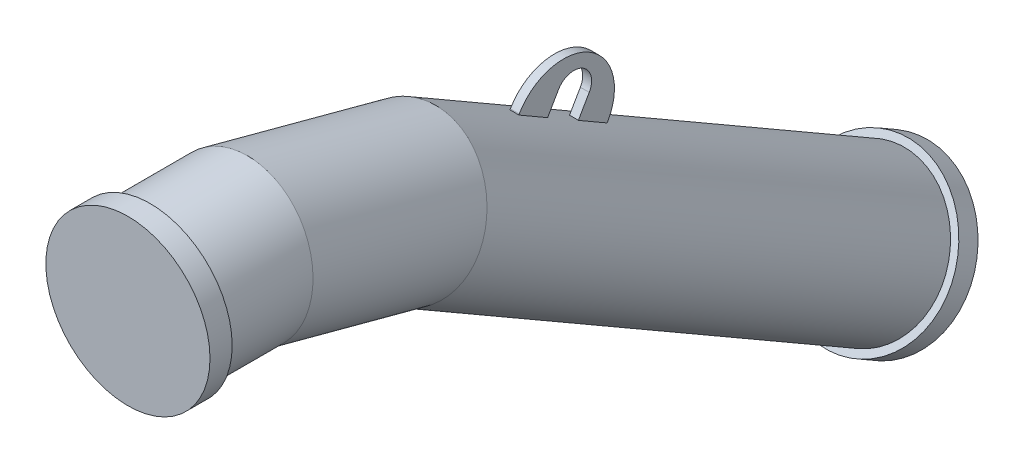
ISO-10303-21;
HEADER;
FILE_DESCRIPTION(('STEP AP214'),'2;1');
FILE_NAME('part.step','',(''),(''),'','','');
FILE_SCHEMA(('AUTOMOTIVE_DESIGN { 1 0 10303 214 1 1 1 1 }'));
ENDSEC;
DATA;
#1=APPLICATION_CONTEXT('core data for automotive mechanical design processes');
#2=APPLICATION_PROTOCOL_DEFINITION('international standard','automotive_design',2000,#1);
#3=PRODUCT_CONTEXT('',#1,'mechanical');
#4=PRODUCT('Part','Part','',(#3));
#5=PRODUCT_RELATED_PRODUCT_CATEGORY('part','',(#4));
#6=PRODUCT_DEFINITION_FORMATION('','',#4);
#7=PRODUCT_DEFINITION_CONTEXT('part definition',#1,'design');
#8=PRODUCT_DEFINITION('design','',#6,#7);
#9=PRODUCT_DEFINITION_SHAPE('','',#8);
#10=(LENGTH_UNIT() NAMED_UNIT(*) SI_UNIT(.MILLI.,.METRE.));
#11=(NAMED_UNIT(*) PLANE_ANGLE_UNIT() SI_UNIT($,.RADIAN.));
#12=(NAMED_UNIT(*) SI_UNIT($,.STERADIAN.) SOLID_ANGLE_UNIT());
#13=UNCERTAINTY_MEASURE_WITH_UNIT(LENGTH_MEASURE(1.E-05),#10,'distance_accuracy_value','');
#14=(GEOMETRIC_REPRESENTATION_CONTEXT(3) GLOBAL_UNCERTAINTY_ASSIGNED_CONTEXT((#13)) GLOBAL_UNIT_ASSIGNED_CONTEXT((#10,
#11,#12)) REPRESENTATION_CONTEXT('',''));
#15=CARTESIAN_POINT('',(0.,0.,0.));
#16=DIRECTION('',(0.,0.,1.));
#17=DIRECTION('',(1.,0.,0.));
#18=AXIS2_PLACEMENT_3D('',#15,#16,#17);
#19=CARTESIAN_POINT('',(-1.22158554920735E-13,-301.111260566399,-747.501896355455));
#20=DIRECTION('',(0.,-0.5,-0.866025403784436));
#21=DIRECTION('',(-1.,0.,0.));
#22=AXIS2_PLACEMENT_3D('',#19,#20,#21);
#23=CYLINDRICAL_SURFACE('',#22,84.15);
#24=CARTESIAN_POINT('',(0.,-115.480947161671,-425.980762113534));
#25=DIRECTION('',(0.,0.500000000000003,0.866025403784441));
#26=DIRECTION('',(0.,-0.866025403784438,0.500000000000001));
#27=AXIS2_PLACEMENT_3D('',#24,#25,#26);
#28=CIRCLE('',#27,84.15);
#29=CARTESIAN_POINT('',(5.00000000000004,-42.7336662846523,-467.981424310695));
#30=VERTEX_POINT('',#29);
#31=CARTESIAN_POINT('',(-4.99999999999996,-42.7336662846523,-467.981424310695));
#32=VERTEX_POINT('',#31);
#33=EDGE_CURVE('E351',#30,#32,#28,.T.);
#34=ORIENTED_EDGE('',*,*,#33,.F.);
#35=DIRECTION('',(0.,-0.5,-0.866025403784436));
#36=VECTOR('',#35,1.);
#37=CARTESIAN_POINT('',(4.99999999999993,-228.363979689379,-789.502558552615));
#38=LINE('',#37,#36);
#39=CARTESIAN_POINT('',(5.00000000000006,-23.9836662846514,-435.505471668778));
#40=VERTEX_POINT('',#39);
#41=EDGE_CURVE('E347',#30,#40,#38,.F.);
#42=ORIENTED_EDGE('',*,*,#41,.T.);
#43=CARTESIAN_POINT('',(0.,-96.7309471616711,-393.504809471617));
#44=DIRECTION('',(0.,-0.500000000000001,-0.866025403784438));
#45=DIRECTION('',(0.,0.866025403784438,-0.500000000000001));
#46=AXIS2_PLACEMENT_3D('',#43,#44,#45);
#47=CIRCLE('',#46,84.15);
#48=CARTESIAN_POINT('',(-4.99999999999994,-23.9836662846514,-435.505471668778));
#49=VERTEX_POINT('',#48);
#50=EDGE_CURVE('E339',#49,#40,#47,.T.);
#51=ORIENTED_EDGE('',*,*,#50,.F.);
#52=DIRECTION('',(0.,-0.5,-0.866025403784436));
#53=VECTOR('',#52,1.);
#54=CARTESIAN_POINT('',(-5.00000000000007,-228.363979689379,-789.502558552615));
#55=LINE('',#54,#53);
#56=EDGE_CURVE('E343',#32,#49,#55,.F.);
#57=ORIENTED_EDGE('',*,*,#56,.F.);
#58=EDGE_LOOP('',(#34,#42,#51,#57));
#59=FACE_BOUND('',#58,.T.);
#60=CARTESIAN_POINT('',(-1.47473457933183E-13,-350.480947161672,-833.01270189222));
#61=DIRECTION('',(0.,0.5,0.866025403784436));
#62=DIRECTION('',(1.,0.,0.));
#63=AXIS2_PLACEMENT_3D('',#60,#61,#62);
#64=CIRCLE('',#63,84.15);
#65=CARTESIAN_POINT('',(84.1499999999998,-350.480947161672,-833.01270189222));
#66=VERTEX_POINT('',#65);
#67=EDGE_CURVE('E256',#66,#66,#64,.T.);
#68=ORIENTED_EDGE('',*,*,#67,.T.);
#69=EDGE_LOOP('',(#68));
#70=FACE_BOUND('',#69,.T.);
#71=CARTESIAN_POINT('',(0.,-51.1112605663985,-314.489194463236));
#72=DIRECTION('',(0.,0.38268343236509,0.923879532511284));
#73=DIRECTION('',(0.,-0.923879532511286,0.382683432365092));
#74=AXIS2_PLACEMENT_3D('',#71,#72,#73);
#75=ELLIPSE('',#74,84.8761270328199,84.15);
#76=CARTESIAN_POINT('',(-1.06085121813029E-13,-129.526577130849,-282.008506844461));
#77=VERTEX_POINT('',#76);
#78=EDGE_CURVE('E332',#77,#77,#75,.T.);
#79=ORIENTED_EDGE('',*,*,#78,.F.);
#80=EDGE_LOOP('',(#79));
#81=FACE_BOUND('',#80,.T.);
#82=CARTESIAN_POINT('',(0.,-135.480947161671,-460.621778264911));
#83=DIRECTION('',(0.,-0.500000000000002,-0.86602540378444));
#84=DIRECTION('',(0.,0.866025403784438,-0.500000000000001));
#85=AXIS2_PLACEMENT_3D('',#82,#83,#84);
#86=CIRCLE('',#85,84.15);
#87=CARTESIAN_POINT('',(-4.99999999999998,-62.7336662846523,-502.622440462072));
#88=VERTEX_POINT('',#87);
#89=CARTESIAN_POINT('',(5.00000000000003,-62.7336662846523,-502.622440462072));
#90=VERTEX_POINT('',#89);
#91=EDGE_CURVE('E10',#88,#90,#86,.T.);
#92=ORIENTED_EDGE('',*,*,#91,.F.);
#93=CARTESIAN_POINT('',(-4.99999999999997,-81.4836662846517,-535.098393103988));
#94=VERTEX_POINT('',#93);
#95=EDGE_CURVE('E348',#94,#88,#55,.F.);
#96=ORIENTED_EDGE('',*,*,#95,.F.);
#97=CARTESIAN_POINT('',(0.,-154.230947161671,-493.097730906827));
#98=DIRECTION('',(0.,0.500000000000001,0.866025403784438));
#99=DIRECTION('',(0.,-0.866025403784438,0.500000000000001));
#100=AXIS2_PLACEMENT_3D('',#97,#98,#99);
#101=CIRCLE('',#100,84.15);
#102=CARTESIAN_POINT('',(5.00000000000003,-81.4836662846517,-535.098393103988));
#103=VERTEX_POINT('',#102);
#104=EDGE_CURVE('E354',#103,#94,#101,.T.);
#105=ORIENTED_EDGE('',*,*,#104,.F.);
#106=EDGE_CURVE('E25',#103,#90,#38,.F.);
#107=ORIENTED_EDGE('',*,*,#106,.T.);
#108=EDGE_LOOP('',(#92,#96,#105,#107));
#109=FACE_BOUND('',#108,.T.);
#110=ADVANCED_FACE('F16',(#59,#70,#81,#109),#23,.T.);
#111=CARTESIAN_POINT('',(0.,-51.1112605663978,-314.489194463235));
#112=DIRECTION('',(0.,0.258819045102521,0.965925826289068));
#113=DIRECTION('',(0.,-0.965925826289068,0.258819045102521));
#114=AXIS2_PLACEMENT_3D('',#111,#112,#113);
#115=CYLINDRICAL_SURFACE('',#114,84.15);
#116=ORIENTED_EDGE('',*,*,#78,.T.);
#117=EDGE_LOOP('',(#116));
#118=FACE_BOUND('',#117,.T.);
#119=CARTESIAN_POINT('',(0.,0.,-123.739373190547));
#120=DIRECTION('',(0.,0.130526192220052,0.99144486137381));
#121=DIRECTION('',(0.,0.99144486137381,-0.130526192220052));
#122=AXIS2_PLACEMENT_3D('',#119,#120,#121);
#123=ELLIPSE('',#122,84.8761270328199,84.15);
#124=CARTESIAN_POINT('',(0.,84.15,-134.817930862526));
#125=VERTEX_POINT('',#124);
#126=EDGE_CURVE('E325',#125,#125,#123,.T.);
#127=ORIENTED_EDGE('',*,*,#126,.F.);
#128=EDGE_LOOP('',(#127));
#129=FACE_BOUND('',#128,.T.);
#130=ADVANCED_FACE('F542',(#118,#129),#115,.T.);
#131=CARTESIAN_POINT('',(0.,0.,-123.739373190547));
#132=DIRECTION('',(0.,0.,1.));
#133=DIRECTION('',(1.,0.,0.));
#134=AXIS2_PLACEMENT_3D('',#131,#132,#133);
#135=CYLINDRICAL_SURFACE('',#134,84.15);
#136=CARTESIAN_POINT('',(0.,0.,-25.));
#137=DIRECTION('',(0.,0.,-1.));
#138=DIRECTION('',(-1.,0.,0.));
#139=AXIS2_PLACEMENT_3D('',#136,#137,#138);
#140=CIRCLE('',#139,84.15);
#141=CARTESIAN_POINT('',(-84.15,0.,-25.));
#142=VERTEX_POINT('',#141);
#143=EDGE_CURVE('E264',#142,#142,#140,.T.);
#144=ORIENTED_EDGE('',*,*,#143,.T.);
#145=EDGE_LOOP('',(#144));
#146=FACE_BOUND('',#145,.T.);
#147=ORIENTED_EDGE('',*,*,#126,.T.);
#148=EDGE_LOOP('',(#147));
#149=FACE_BOUND('',#148,.T.);
#150=ADVANCED_FACE('F379',(#146,#149),#135,.T.);
#151=CARTESIAN_POINT('',(5.00000000000004,-31.5171908510598,-497.551270189223));
#152=DIRECTION('',(1.,0.,0.));
#153=DIRECTION('',(0.,0.86602540378444,-0.500000000000002));
#154=AXIS2_PLACEMENT_3D('',#151,#152,#153);
#155=PLANE('',#154);
#156=ORIENTED_EDGE('',*,*,#106,.F.);
#157=DIRECTION('',(0.,0.866025403784438,-0.500000000000001));
#158=VECTOR('',#157,1.);
#159=CARTESIAN_POINT('',(5.00000000000003,-89.2790418778385,-530.597730906828));
#160=LINE('',#159,#158);
#161=CARTESIAN_POINT('',(5.00000000000003,-80.6187878399943,-535.597730906828));
#162=VERTEX_POINT('',#161);
#163=EDGE_CURVE('E275',#103,#162,#160,.T.);
#164=ORIENTED_EDGE('',*,*,#163,.T.);
#165=CARTESIAN_POINT('',(5.00000000000005,-51.8687878399942,-485.801270189222));
#166=DIRECTION('',(1.,0.,0.));
#167=DIRECTION('',(0.,0.86602540378444,-0.500000000000002));
#168=AXIS2_PLACEMENT_3D('',#165,#166,#167);
#169=CIRCLE('',#168,57.5);
#170=CARTESIAN_POINT('',(5.00000000000006,-23.1187878399938,-436.004809471617));
#171=VERTEX_POINT('',#170);
#172=EDGE_CURVE('E293',#162,#171,#169,.T.);
#173=ORIENTED_EDGE('',*,*,#172,.T.);
#174=DIRECTION('',(0.,0.866025403784438,-0.500000000000001));
#175=VECTOR('',#174,1.);
#176=CARTESIAN_POINT('',(5.00000000000006,-31.7790418778382,-431.004809471617));
#177=LINE('',#176,#175);
#178=EDGE_CURVE('E269',#40,#171,#177,.T.);
#179=ORIENTED_EDGE('',*,*,#178,.F.);
#180=ORIENTED_EDGE('',*,*,#41,.F.);
#181=DIRECTION('',(0.,0.866025403784441,-0.500000000000003));
#182=VECTOR('',#181,1.);
#183=CARTESIAN_POINT('',(5.00000000000006,-41.8687878399941,-468.480762113534));
#184=LINE('',#183,#182);
#185=CARTESIAN_POINT('',(5.00000000000006,-21.5171908510598,-480.230762113534));
#186=VERTEX_POINT('',#185);
#187=EDGE_CURVE('E282',#30,#186,#184,.T.);
#188=ORIENTED_EDGE('',*,*,#187,.T.);
#189=CARTESIAN_POINT('',(5.00000000000004,-31.5171908510598,-497.551270189223));
#190=DIRECTION('',(-1.,0.,0.));
#191=DIRECTION('',(0.,0.86602540378444,-0.500000000000002));
#192=AXIS2_PLACEMENT_3D('',#189,#190,#191);
#193=CIRCLE('',#192,20.);
#194=CARTESIAN_POINT('',(5.00000000000004,-41.5171908510599,-514.871778264911));
#195=VERTEX_POINT('',#194);
#196=EDGE_CURVE('E285',#186,#195,#193,.T.);
#197=ORIENTED_EDGE('',*,*,#196,.T.);
#198=DIRECTION('',(0.,-0.86602540378444,0.500000000000002));
#199=VECTOR('',#198,1.);
#200=CARTESIAN_POINT('',(5.00000000000004,-61.8687878399942,-503.121778264911));
#201=LINE('',#200,#199);
#202=EDGE_CURVE('E289',#195,#90,#201,.T.);
#203=ORIENTED_EDGE('',*,*,#202,.T.);
#204=EDGE_LOOP('',(#156,#164,#173,#179,#180,#188,#197,#203));
#205=FACE_BOUND('',#204,.T.);
#206=ADVANCED_FACE('F456',(#205),#155,.T.);
#207=CARTESIAN_POINT('',(-4.99999999999996,-31.5171908510598,-497.551270189223));
#208=DIRECTION('',(1.,0.,0.));
#209=DIRECTION('',(0.,0.86602540378444,-0.500000000000002));
#210=AXIS2_PLACEMENT_3D('',#207,#208,#209);
#211=PLANE('',#210);
#212=DIRECTION('',(0.,0.866025403784438,-0.500000000000001));
#213=VECTOR('',#212,1.);
#214=CARTESIAN_POINT('',(-4.99999999999997,-89.2790418778385,-530.597730906828));
#215=LINE('',#214,#213);
#216=CARTESIAN_POINT('',(-4.99999999999997,-80.6187878399942,-535.597730906828));
#217=VERTEX_POINT('',#216);
#218=EDGE_CURVE('E278',#94,#217,#215,.T.);
#219=ORIENTED_EDGE('',*,*,#218,.F.);
#220=ORIENTED_EDGE('',*,*,#95,.T.);
#221=DIRECTION('',(0.,-0.86602540378444,0.500000000000002));
#222=VECTOR('',#221,1.);
#223=CARTESIAN_POINT('',(-4.99999999999996,-61.8687878399942,-503.121778264911));
#224=LINE('',#223,#222);
#225=CARTESIAN_POINT('',(-4.99999999999996,-41.5171908510599,-514.871778264911));
#226=VERTEX_POINT('',#225);
#227=EDGE_CURVE('E303',#226,#88,#224,.T.);
#228=ORIENTED_EDGE('',*,*,#227,.F.);
#229=CARTESIAN_POINT('',(-4.99999999999996,-31.5171908510598,-497.551270189223));
#230=DIRECTION('',(-1.,0.,0.));
#231=DIRECTION('',(0.,0.86602540378444,-0.500000000000002));
#232=AXIS2_PLACEMENT_3D('',#229,#230,#231);
#233=CIRCLE('',#232,20.);
#234=CARTESIAN_POINT('',(-4.99999999999995,-21.5171908510598,-480.230762113534));
#235=VERTEX_POINT('',#234);
#236=EDGE_CURVE('E300',#235,#226,#233,.T.);
#237=ORIENTED_EDGE('',*,*,#236,.F.);
#238=DIRECTION('',(0.,0.866025403784441,-0.500000000000003));
#239=VECTOR('',#238,1.);
#240=CARTESIAN_POINT('',(-4.99999999999995,-41.8687878399941,-468.480762113534));
#241=LINE('',#240,#239);
#242=EDGE_CURVE('E281',#32,#235,#241,.T.);
#243=ORIENTED_EDGE('',*,*,#242,.F.);
#244=ORIENTED_EDGE('',*,*,#56,.T.);
#245=DIRECTION('',(0.,0.866025403784438,-0.500000000000001));
#246=VECTOR('',#245,1.);
#247=CARTESIAN_POINT('',(-4.99999999999994,-31.7790418778382,-431.004809471617));
#248=LINE('',#247,#246);
#249=CARTESIAN_POINT('',(-4.99999999999994,-23.1187878399938,-436.004809471617));
#250=VERTEX_POINT('',#249);
#251=EDGE_CURVE('E272',#49,#250,#248,.T.);
#252=ORIENTED_EDGE('',*,*,#251,.T.);
#253=CARTESIAN_POINT('',(-4.99999999999995,-51.8687878399942,-485.801270189222));
#254=DIRECTION('',(1.,0.,0.));
#255=DIRECTION('',(0.,0.86602540378444,-0.500000000000002));
#256=AXIS2_PLACEMENT_3D('',#253,#254,#255);
#257=CIRCLE('',#256,57.5);
#258=EDGE_CURVE('E286',#217,#250,#257,.T.);
#259=ORIENTED_EDGE('',*,*,#258,.F.);
#260=EDGE_LOOP('',(#219,#220,#228,#237,#243,#244,#252,#259));
#261=FACE_BOUND('',#260,.T.);
#262=ADVANCED_FACE('F461',(#261),#211,.F.);
#263=CARTESIAN_POINT('',(5.00000000000006,-41.8687878399941,-468.480762113534));
#264=DIRECTION('',(0.,0.500000000000003,0.866025403784441));
#265=DIRECTION('',(0.,-0.866025403784441,0.500000000000003));
#266=AXIS2_PLACEMENT_3D('',#263,#264,#265);
#267=PLANE('',#266);
#268=ORIENTED_EDGE('',*,*,#187,.F.);
#269=ORIENTED_EDGE('',*,*,#33,.T.);
#270=ORIENTED_EDGE('',*,*,#242,.T.);
#271=DIRECTION('',(-1.,0.,0.));
#272=VECTOR('',#271,1.);
#273=CARTESIAN_POINT('',(5.00000000000006,-21.5171908510598,-480.230762113534));
#274=LINE('',#273,#272);
#275=EDGE_CURVE('E321',#186,#235,#274,.T.);
#276=ORIENTED_EDGE('',*,*,#275,.F.);
#277=EDGE_LOOP('',(#268,#269,#270,#276));
#278=FACE_BOUND('',#277,.T.);
#279=ADVANCED_FACE('F520',(#278),#267,.F.);
#280=CARTESIAN_POINT('',(5.00000000000004,-31.5171908510598,-497.551270189223));
#281=DIRECTION('',(-1.,0.,0.));
#282=DIRECTION('',(0.,-0.86602540378444,0.500000000000002));
#283=AXIS2_PLACEMENT_3D('',#280,#281,#282);
#284=CYLINDRICAL_SURFACE('',#283,20.);
#285=ORIENTED_EDGE('',*,*,#236,.T.);
#286=DIRECTION('',(-1.,0.,0.));
#287=VECTOR('',#286,1.);
#288=CARTESIAN_POINT('',(5.00000000000004,-41.5171908510599,-514.871778264911));
#289=LINE('',#288,#287);
#290=EDGE_CURVE('E317',#195,#226,#289,.T.);
#291=ORIENTED_EDGE('',*,*,#290,.F.);
#292=ORIENTED_EDGE('',*,*,#196,.F.);
#293=ORIENTED_EDGE('',*,*,#275,.T.);
#294=EDGE_LOOP('',(#285,#291,#292,#293));
#295=FACE_BOUND('',#294,.T.);
#296=ADVANCED_FACE('F605',(#295),#284,.F.);
#297=CARTESIAN_POINT('',(5.00000000000004,-61.8687878399942,-503.121778264911));
#298=DIRECTION('',(0.,-0.500000000000002,-0.86602540378444));
#299=DIRECTION('',(0.,0.86602540378444,-0.500000000000002));
#300=AXIS2_PLACEMENT_3D('',#297,#298,#299);
#301=PLANE('',#300);
#302=ORIENTED_EDGE('',*,*,#227,.T.);
#303=ORIENTED_EDGE('',*,*,#91,.T.);
#304=ORIENTED_EDGE('',*,*,#202,.F.);
#305=ORIENTED_EDGE('',*,*,#290,.T.);
#306=EDGE_LOOP('',(#302,#303,#304,#305));
#307=FACE_BOUND('',#306,.T.);
#308=ADVANCED_FACE('F749',(#307),#301,.F.);
#309=CARTESIAN_POINT('',(5.00000000000005,-51.8687878399942,-485.801270189222));
#310=DIRECTION('',(-1.,0.,0.));
#311=DIRECTION('',(0.,-0.86602540378444,0.500000000000002));
#312=AXIS2_PLACEMENT_3D('',#309,#310,#311);
#313=CYLINDRICAL_SURFACE('',#312,57.5);
#314=ORIENTED_EDGE('',*,*,#258,.T.);
#315=DIRECTION('',(-1.,0.,0.));
#316=VECTOR('',#315,1.);
#317=CARTESIAN_POINT('',(5.00000000000006,-23.1187878399938,-436.004809471617));
#318=LINE('',#317,#316);
#319=EDGE_CURVE('E297',#171,#250,#318,.T.);
#320=ORIENTED_EDGE('',*,*,#319,.F.);
#321=ORIENTED_EDGE('',*,*,#172,.F.);
#322=DIRECTION('',(-1.,0.,0.));
#323=VECTOR('',#322,1.);
#324=CARTESIAN_POINT('',(5.00000000000003,-80.6187878399943,-535.597730906828));
#325=LINE('',#324,#323);
#326=EDGE_CURVE('E313',#162,#217,#325,.T.);
#327=ORIENTED_EDGE('',*,*,#326,.T.);
#328=EDGE_LOOP('',(#314,#320,#321,#327));
#329=FACE_BOUND('',#328,.T.);
#330=ADVANCED_FACE('F742',(#329),#313,.T.);
#331=CARTESIAN_POINT('',(-4.99999999999997,-89.2790418778385,-530.597730906828));
#332=DIRECTION('',(0.,0.500000000000001,0.866025403784438));
#333=DIRECTION('',(0.,-0.866025403784438,0.500000000000001));
#334=AXIS2_PLACEMENT_3D('',#331,#332,#333);
#335=PLANE('',#334);
#336=ORIENTED_EDGE('',*,*,#163,.F.);
#337=ORIENTED_EDGE('',*,*,#104,.T.);
#338=ORIENTED_EDGE('',*,*,#218,.T.);
#339=ORIENTED_EDGE('',*,*,#326,.F.);
#340=EDGE_LOOP('',(#336,#337,#338,#339));
#341=FACE_BOUND('',#340,.T.);
#342=ADVANCED_FACE('F731',(#341),#335,.F.);
#343=CARTESIAN_POINT('',(5.00000000000006,-31.7790418778382,-431.004809471617));
#344=DIRECTION('',(0.,-0.500000000000001,-0.866025403784438));
#345=DIRECTION('',(0.,0.866025403784438,-0.500000000000001));
#346=AXIS2_PLACEMENT_3D('',#343,#344,#345);
#347=PLANE('',#346);
#348=ORIENTED_EDGE('',*,*,#251,.F.);
#349=ORIENTED_EDGE('',*,*,#50,.T.);
#350=ORIENTED_EDGE('',*,*,#178,.T.);
#351=ORIENTED_EDGE('',*,*,#319,.T.);
#352=EDGE_LOOP('',(#348,#349,#350,#351));
#353=FACE_BOUND('',#352,.T.);
#354=ADVANCED_FACE('F586',(#353),#347,.F.);
#355=CARTESIAN_POINT('',(0.,0.,0.));
#356=DIRECTION('',(0.,0.,0.999999999999998));
#357=DIRECTION('',(1.,0.,0.));
#358=AXIS2_PLACEMENT_3D('',#355,#356,#357);
#359=PLANE('',#358);
#360=CARTESIAN_POINT('',(0.,0.,0.));
#361=DIRECTION('',(0.,0.,0.999999999999998));
#362=DIRECTION('',(1.,0.,0.));
#363=AXIS2_PLACEMENT_3D('',#360,#361,#362);
#364=CIRCLE('',#363,92.5);
#365=CARTESIAN_POINT('',(92.5,0.,0.));
#366=VERTEX_POINT('',#365);
#367=EDGE_CURVE('E265',#366,#366,#364,.T.);
#368=ORIENTED_EDGE('',*,*,#367,.T.);
#369=EDGE_LOOP('',(#368));
#370=FACE_BOUND('',#369,.T.);
#371=ADVANCED_FACE('F441',(#370),#359,.T.);
#372=CARTESIAN_POINT('',(0.,0.,-25.0000000000001));
#373=DIRECTION('',(0.,0.,0.999999999999998));
#374=DIRECTION('',(1.,0.,0.));
#375=AXIS2_PLACEMENT_3D('',#372,#373,#374);
#376=CYLINDRICAL_SURFACE('',#375,92.5);
#377=CARTESIAN_POINT('',(0.,0.,-25.0000000000001));
#378=DIRECTION('',(0.,0.,0.999999999999998));
#379=DIRECTION('',(1.,0.,0.));
#380=AXIS2_PLACEMENT_3D('',#377,#378,#379);
#381=CIRCLE('',#380,92.5);
#382=CARTESIAN_POINT('',(92.5,0.,-25.0000000000001));
#383=VERTEX_POINT('',#382);
#384=EDGE_CURVE('E260',#383,#383,#381,.T.);
#385=ORIENTED_EDGE('',*,*,#384,.T.);
#386=EDGE_LOOP('',(#385));
#387=FACE_BOUND('',#386,.T.);
#388=ORIENTED_EDGE('',*,*,#367,.F.);
#389=EDGE_LOOP('',(#388));
#390=FACE_BOUND('',#389,.T.);
#391=ADVANCED_FACE('F436',(#387,#390),#376,.T.);
#392=CARTESIAN_POINT('',(0.,0.,-25.0000000000001));
#393=DIRECTION('',(0.,0.,0.999999999999998));
#394=DIRECTION('',(1.,0.,0.));
#395=AXIS2_PLACEMENT_3D('',#392,#393,#394);
#396=PLANE('',#395);
#397=ORIENTED_EDGE('',*,*,#143,.F.);
#398=EDGE_LOOP('',(#397));
#399=FACE_BOUND('',#398,.T.);
#400=ORIENTED_EDGE('',*,*,#384,.F.);
#401=EDGE_LOOP('',(#400));
#402=FACE_BOUND('',#401,.T.);
#403=ADVANCED_FACE('F440',(#399,#402),#396,.F.);
#404=CARTESIAN_POINT('',(-1.53646177366187E-13,-362.980947161672,-854.66333698683));
#405=DIRECTION('',(0.,-0.5,-0.866025403784436));
#406=DIRECTION('',(-1.,0.,0.));
#407=AXIS2_PLACEMENT_3D('',#404,#405,#406);
#408=PLANE('',#407);
#409=CARTESIAN_POINT('',(-1.53646177366187E-13,-362.980947161672,-854.66333698683));
#410=DIRECTION('',(0.,-0.5,-0.866025403784436));
#411=DIRECTION('',(-1.,0.,0.));
#412=AXIS2_PLACEMENT_3D('',#409,#410,#411);
#413=CIRCLE('',#412,92.5);
#414=CARTESIAN_POINT('',(-92.5000000000002,-362.980947161672,-854.66333698683));
#415=VERTEX_POINT('',#414);
#416=EDGE_CURVE('E244',#415,#415,#413,.T.);
#417=ORIENTED_EDGE('',*,*,#416,.T.);
#418=EDGE_LOOP('',(#417));
#419=FACE_BOUND('',#418,.T.);
#420=ADVANCED_FACE('F505',(#419),#408,.T.);
#421=CARTESIAN_POINT('',(-1.47545713399616E-13,-350.480947161672,-833.012701892219));
#422=DIRECTION('',(0.,-0.5,-0.866025403784436));
#423=DIRECTION('',(-1.,0.,0.));
#424=AXIS2_PLACEMENT_3D('',#421,#422,#423);
#425=CYLINDRICAL_SURFACE('',#424,92.5);
#426=CARTESIAN_POINT('',(-1.47545713399616E-13,-350.480947161672,-833.012701892219));
#427=DIRECTION('',(0.,-0.5,-0.866025403784436));
#428=DIRECTION('',(-1.,0.,0.));
#429=AXIS2_PLACEMENT_3D('',#426,#427,#428);
#430=CIRCLE('',#429,92.5);
#431=CARTESIAN_POINT('',(-92.5000000000002,-350.480947161672,-833.012701892219));
#432=VERTEX_POINT('',#431);
#433=EDGE_CURVE('E252',#432,#432,#430,.T.);
#434=ORIENTED_EDGE('',*,*,#433,.T.);
#435=EDGE_LOOP('',(#434));
#436=FACE_BOUND('',#435,.T.);
#437=ORIENTED_EDGE('',*,*,#416,.F.);
#438=EDGE_LOOP('',(#437));
#439=FACE_BOUND('',#438,.T.);
#440=ADVANCED_FACE('F812',(#436,#439),#425,.T.);
#441=CARTESIAN_POINT('',(-1.47545713399616E-13,-350.480947161672,-833.012701892219));
#442=DIRECTION('',(0.,-0.5,-0.866025403784436));
#443=DIRECTION('',(-1.,0.,0.));
#444=AXIS2_PLACEMENT_3D('',#441,#442,#443);
#445=PLANE('',#444);
#446=ORIENTED_EDGE('',*,*,#67,.F.);
#447=EDGE_LOOP('',(#446));
#448=FACE_BOUND('',#447,.T.);
#449=ORIENTED_EDGE('',*,*,#433,.F.);
#450=EDGE_LOOP('',(#449));
#451=FACE_BOUND('',#450,.T.);
#452=ADVANCED_FACE('F816',(#448,#451),#445,.F.);
#453=CLOSED_SHELL('',(#110,#130,#150,#206,#262,#279,#296,#308,#330,#342,#354,#371,#391,#403,
#420,#440,#452));
#454=CARTESIAN_POINT('',(0.,0.,-25.));
#455=DIRECTION('',(0.,0.,1.));
#456=DIRECTION('',(1.,0.,0.));
#457=AXIS2_PLACEMENT_3D('',#454,#455,#456);
#458=PLANE('',#457);
#459=CARTESIAN_POINT('',(0.,0.,-25.));
#460=DIRECTION('',(0.,0.,-1.));
#461=DIRECTION('',(0.,1.,0.));
#462=AXIS2_PLACEMENT_3D('',#459,#460,#461);
#463=CIRCLE('',#462,35.);
#464=CARTESIAN_POINT('',(0.,35.,-25.));
#465=VERTEX_POINT('',#464);
#466=EDGE_CURVE('E245',#465,#465,#463,.T.);
#467=ORIENTED_EDGE('',*,*,#466,.T.);
#468=EDGE_LOOP('',(#467));
#469=FACE_BOUND('',#468,.T.);
#470=ADVANCED_FACE('F830',(#469),#458,.F.);
#471=CARTESIAN_POINT('',(0.,-750.,-24.9999999999998));
#472=DIRECTION('',(-1.00000000000001,0.,0.));
#473=DIRECTION('',(0.,0.,1.));
#474=AXIS2_PLACEMENT_3D('',#471,#472,#473);
#475=TOROIDAL_SURFACE('',#474,750.,35.);
#476=CARTESIAN_POINT('',(0.,-100.480947161671,-400.000000000001));
#477=DIRECTION('',(0.,0.500000000000002,0.866025403784438));
#478=DIRECTION('',(1.,0.,0.));
#479=AXIS2_PLACEMENT_3D('',#476,#477,#478);
#480=CIRCLE('',#479,35.);
#481=CARTESIAN_POINT('',(0.,-70.1700580292162,-417.500000000001));
#482=VERTEX_POINT('',#481);
#483=EDGE_CURVE('E239',#482,#482,#480,.T.);
#484=CARTESIAN_POINT('',(0.,-750.,-24.9999999999998));
#485=DIRECTION('',(-1.00000000000001,0.,0.));
#486=DIRECTION('',(0.,0.,1.));
#487=AXIS2_PLACEMENT_3D('',#484,#485,#486);
#488=CIRCLE('',#487,785.);
#489=EDGE_CURVE('',#465,#482,#488,.T.);
#490=ORIENTED_EDGE('',*,*,#466,.F.);
#491=ORIENTED_EDGE('',*,*,#483,.F.);
#492=ORIENTED_EDGE('',*,*,#489,.T.);
#493=ORIENTED_EDGE('',*,*,#489,.F.);
#494=EDGE_LOOP('',(#490,#492,#491,#493));
#495=FACE_BOUND('',#494,.T.);
#496=ADVANCED_FACE('F833',(#495),#475,.F.);
#497=CARTESIAN_POINT('',(0.,-100.480947161671,-400.000000000001));
#498=DIRECTION('',(0.,-0.500000000000002,-0.866025403784438));
#499=DIRECTION('',(-1.,0.,0.));
#500=AXIS2_PLACEMENT_3D('',#497,#498,#499);
#501=CYLINDRICAL_SURFACE('',#500,35.);
#502=ORIENTED_EDGE('',*,*,#483,.T.);
#503=EDGE_LOOP('',(#502));
#504=FACE_BOUND('',#503,.T.);
#505=CARTESIAN_POINT('',(-1.52298914951951E-13,-360.480947161672,-850.333209967908));
#506=DIRECTION('',(0.,0.5,0.866025403784436));
#507=DIRECTION('',(0.,-0.866025403784438,0.500000000000001));
#508=AXIS2_PLACEMENT_3D('',#505,#506,#507);
#509=CIRCLE('',#508,35.);
#510=CARTESIAN_POINT('',(-1.52298914951951E-13,-390.791836294127,-832.833209967908));
#511=VERTEX_POINT('',#510);
#512=EDGE_CURVE('E240',#511,#511,#509,.T.);
#513=ORIENTED_EDGE('',*,*,#512,.F.);
#514=EDGE_LOOP('',(#513));
#515=FACE_BOUND('',#514,.T.);
#516=ADVANCED_FACE('F841',(#504,#515),#501,.F.);
#517=CARTESIAN_POINT('',(-1.52426084572872E-13,-360.480947161671,-850.333209967909));
#518=DIRECTION('',(0.,0.5,0.866025403784436));
#519=DIRECTION('',(1.,0.,0.));
#520=AXIS2_PLACEMENT_3D('',#517,#518,#519);
#521=PLANE('',#520);
#522=ORIENTED_EDGE('',*,*,#512,.T.);
#523=EDGE_LOOP('',(#522));
#524=FACE_BOUND('',#523,.T.);
#525=ADVANCED_FACE('F849',(#524),#521,.T.);
#526=CLOSED_SHELL('',(#470,#496,#516,#525));
#527=CARTESIAN_POINT('',(-27.74454884647,-66.9812661070678,-19.9999999999998));
#528=DIRECTION('',(0.,0.,0.999999999999998));
#529=DIRECTION('',(0.,-1.,0.));
#530=AXIS2_PLACEMENT_3D('',#527,#528,#529);
#531=PLANE('',#530);
#532=CARTESIAN_POINT('',(-27.74454884647,-66.9812661070678,-19.9999999999998));
#533=DIRECTION('',(0.,0.,0.999999999999998));
#534=DIRECTION('',(1.,0.,0.));
#535=AXIS2_PLACEMENT_3D('',#532,#533,#534);
#536=CIRCLE('',#535,7.);
#537=CARTESIAN_POINT('',(-20.74454884647,-66.9812661070678,-19.9999999999998));
#538=VERTEX_POINT('',#537);
#539=EDGE_CURVE('E212',#538,#538,#536,.T.);
#540=ORIENTED_EDGE('',*,*,#539,.F.);
#541=EDGE_LOOP('',(#540));
#542=FACE_BOUND('',#541,.T.);
#543=ADVANCED_FACE('F571',(#542),#531,.F.);
#544=CARTESIAN_POINT('',(-27.74454884647,-66.9812661070678,-19.9999999999998));
#545=DIRECTION('',(0.,0.,0.999999999999998));
#546=DIRECTION('',(1.,0.,0.));
#547=AXIS2_PLACEMENT_3D('',#544,#545,#546);
#548=CONICAL_SURFACE('',#547,7.,1.02974425867665);
#549=CARTESIAN_POINT('',(-27.74454884647,-66.9812661070677,-24.2060243331926));
#550=VERTEX_POINT('',#549);
#551=VERTEX_LOOP('',#550);
#552=FACE_BOUND('',#551,.T.);
#553=ORIENTED_EDGE('',*,*,#539,.T.);
#554=EDGE_LOOP('',(#553));
#555=FACE_BOUND('',#554,.T.);
#556=ADVANCED_FACE('F569',(#552,#555),#548,.F.);
#557=CLOSED_SHELL('',(#543,#556));
#558=CARTESIAN_POINT('',(-66.9812661070689,-27.7445488464678,-20.));
#559=DIRECTION('',(0.,0.,0.999999999999998));
#560=DIRECTION('',(0.,-1.,0.));
#561=AXIS2_PLACEMENT_3D('',#558,#559,#560);
#562=PLANE('',#561);
#563=CARTESIAN_POINT('',(-66.9812661070689,-27.7445488464678,-20.));
#564=DIRECTION('',(0.,0.,0.999999999999998));
#565=DIRECTION('',(1.,0.,0.));
#566=AXIS2_PLACEMENT_3D('',#563,#564,#565);
#567=CIRCLE('',#566,6.99999999999999);
#568=CARTESIAN_POINT('',(-59.9812661070689,-27.7445488464678,-20.));
#569=VERTEX_POINT('',#568);
#570=EDGE_CURVE('E210',#569,#569,#567,.T.);
#571=ORIENTED_EDGE('',*,*,#570,.F.);
#572=EDGE_LOOP('',(#571));
#573=FACE_BOUND('',#572,.T.);
#574=ADVANCED_FACE('F419',(#573),#562,.F.);
#575=CARTESIAN_POINT('',(-66.9812661070689,-27.7445488464678,-20.));
#576=DIRECTION('',(0.,0.,0.999999999999998));
#577=DIRECTION('',(1.,0.,0.));
#578=AXIS2_PLACEMENT_3D('',#575,#576,#577);
#579=CONICAL_SURFACE('',#578,6.99999999999999,1.02974425867665);
#580=CARTESIAN_POINT('',(-66.9812661070689,-27.7445488464677,-24.206024333193));
#581=VERTEX_POINT('',#580);
#582=VERTEX_LOOP('',#581);
#583=FACE_BOUND('',#582,.T.);
#584=ORIENTED_EDGE('',*,*,#570,.T.);
#585=EDGE_LOOP('',(#584));
#586=FACE_BOUND('',#585,.T.);
#587=ADVANCED_FACE('F424',(#583,#586),#579,.F.);
#588=CLOSED_SHELL('',(#574,#587));
#589=CARTESIAN_POINT('',(-66.9812661070677,27.7445488464705,-20.));
#590=DIRECTION('',(0.,0.,0.999999999999998));
#591=DIRECTION('',(0.,-1.,0.));
#592=AXIS2_PLACEMENT_3D('',#589,#590,#591);
#593=PLANE('',#592);
#594=CARTESIAN_POINT('',(-66.9812661070677,27.7445488464705,-20.));
#595=DIRECTION('',(0.,0.,0.999999999999998));
#596=DIRECTION('',(1.,0.,0.));
#597=AXIS2_PLACEMENT_3D('',#594,#595,#596);
#598=CIRCLE('',#597,6.99999999999999);
#599=CARTESIAN_POINT('',(-59.9812661070677,27.7445488464705,-20.));
#600=VERTEX_POINT('',#599);
#601=EDGE_CURVE('E182',#600,#600,#598,.T.);
#602=ORIENTED_EDGE('',*,*,#601,.F.);
#603=EDGE_LOOP('',(#602));
#604=FACE_BOUND('',#603,.T.);
#605=ADVANCED_FACE('F802',(#604),#593,.F.);
#606=CARTESIAN_POINT('',(-66.9812661070677,27.7445488464705,-20.));
#607=DIRECTION('',(0.,0.,0.999999999999998));
#608=DIRECTION('',(1.,0.,0.));
#609=AXIS2_PLACEMENT_3D('',#606,#607,#608);
#610=CONICAL_SURFACE('',#609,6.99999999999999,1.02974425867665);
#611=CARTESIAN_POINT('',(-66.9812661070677,27.74454884647,-24.206024333193));
#612=VERTEX_POINT('',#611);
#613=VERTEX_LOOP('',#612);
#614=FACE_BOUND('',#613,.T.);
#615=ORIENTED_EDGE('',*,*,#601,.T.);
#616=EDGE_LOOP('',(#615));
#617=FACE_BOUND('',#616,.T.);
#618=ADVANCED_FACE('F798',(#614,#617),#610,.F.);
#619=CLOSED_SHELL('',(#605,#618));
#620=CARTESIAN_POINT('',(27.7445488464685,-294.973469135305,-870.833461964676));
#621=DIRECTION('',(0.,-0.5,-0.866025403784436));
#622=DIRECTION('',(0.,0.866025403784438,-0.500000000000001));
#623=AXIS2_PLACEMENT_3D('',#620,#621,#622);
#624=PLANE('',#623);
#625=CARTESIAN_POINT('',(27.7445488464685,-294.973469135305,-870.833461964676));
#626=DIRECTION('',(0.,-0.5,-0.866025403784436));
#627=DIRECTION('',(-1.,0.,0.));
#628=AXIS2_PLACEMENT_3D('',#625,#626,#627);
#629=CIRCLE('',#628,7.);
#630=CARTESIAN_POINT('',(20.7445488464685,-294.973469135305,-870.833461964676));
#631=VERTEX_POINT('',#630);
#632=EDGE_CURVE('E173',#631,#631,#629,.T.);
#633=ORIENTED_EDGE('',*,*,#632,.F.);
#634=EDGE_LOOP('',(#633));
#635=FACE_BOUND('',#634,.T.);
#636=ADVANCED_FACE('F907',(#635),#624,.F.);
#637=CARTESIAN_POINT('',(27.7445488464685,-294.973469135305,-870.833461964676));
#638=DIRECTION('',(0.,-0.5,-0.866025403784436));
#639=DIRECTION('',(-1.,0.,0.));
#640=AXIS2_PLACEMENT_3D('',#637,#638,#639);
#641=CONICAL_SURFACE('',#640,7.,1.02974425867665);
#642=CARTESIAN_POINT('',(27.7445488464686,-292.870456968709,-867.190938043196));
#643=VERTEX_POINT('',#642);
#644=VERTEX_LOOP('',#643);
#645=FACE_BOUND('',#644,.T.);
#646=ORIENTED_EDGE('',*,*,#632,.T.);
#647=EDGE_LOOP('',(#646));
#648=FACE_BOUND('',#647,.T.);
#649=ADVANCED_FACE('F909',(#645,#648),#641,.F.);
#650=CLOSED_SHELL('',(#636,#649));
#651=CARTESIAN_POINT('',(27.7445488464686,-66.9812661070682,-20.));
#652=DIRECTION('',(0.,0.,0.999999999999998));
#653=DIRECTION('',(0.,-1.,0.));
#654=AXIS2_PLACEMENT_3D('',#651,#652,#653);
#655=PLANE('',#654);
#656=CARTESIAN_POINT('',(27.7445488464686,-66.9812661070682,-20.));
#657=DIRECTION('',(0.,0.,0.999999999999998));
#658=DIRECTION('',(1.,0.,0.));
#659=AXIS2_PLACEMENT_3D('',#656,#657,#658);
#660=CIRCLE('',#659,6.99999999999999);
#661=CARTESIAN_POINT('',(34.7445488464686,-66.9812661070682,-20.));
#662=VERTEX_POINT('',#661);
#663=EDGE_CURVE('E216',#662,#662,#660,.T.);
#664=ORIENTED_EDGE('',*,*,#663,.F.);
#665=EDGE_LOOP('',(#664));
#666=FACE_BOUND('',#665,.T.);
#667=ADVANCED_FACE('F893',(#666),#655,.F.);
#668=CARTESIAN_POINT('',(27.7445488464686,-66.9812661070682,-20.));
#669=DIRECTION('',(0.,0.,0.999999999999998));
#670=DIRECTION('',(1.,0.,0.));
#671=AXIS2_PLACEMENT_3D('',#668,#669,#670);
#672=CONICAL_SURFACE('',#671,6.99999999999999,1.02974425867665);
#673=CARTESIAN_POINT('',(27.7445488464686,-66.9812661070682,-24.2060243331929));
#674=VERTEX_POINT('',#673);
#675=VERTEX_LOOP('',#674);
#676=FACE_BOUND('',#675,.T.);
#677=ORIENTED_EDGE('',*,*,#663,.T.);
#678=EDGE_LOOP('',(#677));
#679=FACE_BOUND('',#678,.T.);
#680=ADVANCED_FACE('F896',(#676,#679),#672,.F.);
#681=CLOSED_SHELL('',(#667,#680));
#682=CARTESIAN_POINT('',(66.9812661070678,-27.7445488464695,-20.));
#683=DIRECTION('',(0.,0.,0.999999999999998));
#684=DIRECTION('',(0.,-1.,0.));
#685=AXIS2_PLACEMENT_3D('',#682,#683,#684);
#686=PLANE('',#685);
#687=CARTESIAN_POINT('',(66.9812661070678,-27.7445488464695,-20.));
#688=DIRECTION('',(0.,0.,0.999999999999998));
#689=DIRECTION('',(1.,0.,0.));
#690=AXIS2_PLACEMENT_3D('',#687,#688,#689);
#691=CIRCLE('',#690,6.99999999999999);
#692=CARTESIAN_POINT('',(73.9812661070678,-27.7445488464695,-20.));
#693=VERTEX_POINT('',#692);
#694=EDGE_CURVE('E229',#693,#693,#691,.T.);
#695=ORIENTED_EDGE('',*,*,#694,.F.);
#696=EDGE_LOOP('',(#695));
#697=FACE_BOUND('',#696,.T.);
#698=ADVANCED_FACE('F702',(#697),#686,.F.);
#699=CARTESIAN_POINT('',(66.9812661070678,-27.7445488464695,-20.));
#700=DIRECTION('',(0.,0.,0.999999999999998));
#701=DIRECTION('',(1.,0.,0.));
#702=AXIS2_PLACEMENT_3D('',#699,#700,#701);
#703=CONICAL_SURFACE('',#702,6.99999999999999,1.02974425867665);
#704=CARTESIAN_POINT('',(66.9812661070678,-27.7445488464697,-24.206024333193));
#705=VERTEX_POINT('',#704);
#706=VERTEX_LOOP('',#705);
#707=FACE_BOUND('',#706,.T.);
#708=ORIENTED_EDGE('',*,*,#694,.T.);
#709=EDGE_LOOP('',(#708));
#710=FACE_BOUND('',#709,.T.);
#711=ADVANCED_FACE('F699',(#707,#710),#703,.F.);
#712=CLOSED_SHELL('',(#698,#711));
#713=CARTESIAN_POINT('',(66.9812661070686,27.7445488464686,-19.9999999999999));
#714=DIRECTION('',(0.,0.,0.999999999999998));
#715=DIRECTION('',(0.,-1.,0.));
#716=AXIS2_PLACEMENT_3D('',#713,#714,#715);
#717=PLANE('',#716);
#718=CARTESIAN_POINT('',(66.9812661070686,27.7445488464686,-19.9999999999999));
#719=DIRECTION('',(0.,0.,0.999999999999998));
#720=DIRECTION('',(1.,0.,0.));
#721=AXIS2_PLACEMENT_3D('',#718,#719,#720);
#722=CIRCLE('',#721,6.99999999999999);
#723=CARTESIAN_POINT('',(73.9812661070686,27.7445488464686,-19.9999999999999));
#724=VERTEX_POINT('',#723);
#725=EDGE_CURVE('E225',#724,#724,#722,.T.);
#726=ORIENTED_EDGE('',*,*,#725,.F.);
#727=EDGE_LOOP('',(#726));
#728=FACE_BOUND('',#727,.T.);
#729=ADVANCED_FACE('F407',(#728),#717,.F.);
#730=CARTESIAN_POINT('',(66.9812661070686,27.7445488464686,-19.9999999999999));
#731=DIRECTION('',(0.,0.,0.999999999999998));
#732=DIRECTION('',(1.,0.,0.));
#733=AXIS2_PLACEMENT_3D('',#730,#731,#732);
#734=CONICAL_SURFACE('',#733,6.99999999999999,1.02974425867665);
#735=CARTESIAN_POINT('',(66.9812661070686,27.7445488464683,-24.2060243331927));
#736=VERTEX_POINT('',#735);
#737=VERTEX_LOOP('',#736);
#738=FACE_BOUND('',#737,.T.);
#739=ORIENTED_EDGE('',*,*,#725,.T.);
#740=EDGE_LOOP('',(#739));
#741=FACE_BOUND('',#740,.T.);
#742=ADVANCED_FACE('F402',(#738,#741),#734,.F.);
#743=CLOSED_SHELL('',(#729,#742));
#744=CARTESIAN_POINT('',(27.7445488464695,66.9812661070681,-20.));
#745=DIRECTION('',(0.,0.,0.999999999999998));
#746=DIRECTION('',(0.,-1.,0.));
#747=AXIS2_PLACEMENT_3D('',#744,#745,#746);
#748=PLANE('',#747);
#749=CARTESIAN_POINT('',(27.7445488464695,66.9812661070681,-20.));
#750=DIRECTION('',(0.,0.,0.999999999999998));
#751=DIRECTION('',(1.,0.,0.));
#752=AXIS2_PLACEMENT_3D('',#749,#750,#751);
#753=CIRCLE('',#752,7.);
#754=CARTESIAN_POINT('',(34.7445488464695,66.9812661070681,-20.));
#755=VERTEX_POINT('',#754);
#756=EDGE_CURVE('E220',#755,#755,#753,.T.);
#757=ORIENTED_EDGE('',*,*,#756,.F.);
#758=EDGE_LOOP('',(#757));
#759=FACE_BOUND('',#758,.T.);
#760=ADVANCED_FACE('F482',(#759),#748,.F.);
#761=CARTESIAN_POINT('',(27.7445488464695,66.9812661070681,-20.));
#762=DIRECTION('',(0.,0.,0.999999999999998));
#763=DIRECTION('',(1.,0.,0.));
#764=AXIS2_PLACEMENT_3D('',#761,#762,#763);
#765=CONICAL_SURFACE('',#764,7.,1.02974425867665);
#766=CARTESIAN_POINT('',(27.7445488464695,66.9812661070681,-24.2060243331927));
#767=VERTEX_POINT('',#766);
#768=VERTEX_LOOP('',#767);
#769=FACE_BOUND('',#768,.T.);
#770=ORIENTED_EDGE('',*,*,#756,.T.);
#771=EDGE_LOOP('',(#770));
#772=FACE_BOUND('',#771,.T.);
#773=ADVANCED_FACE('F485',(#769,#772),#765,.F.);
#774=CLOSED_SHELL('',(#760,#773));
#775=CARTESIAN_POINT('',(-27.7445488464696,-294.973469135305,-870.833461964676));
#776=DIRECTION('',(0.,-0.5,-0.866025403784436));
#777=DIRECTION('',(0.,0.866025403784438,-0.500000000000001));
#778=AXIS2_PLACEMENT_3D('',#775,#776,#777);
#779=PLANE('',#778);
#780=CARTESIAN_POINT('',(-27.7445488464696,-294.973469135305,-870.833461964676));
#781=DIRECTION('',(0.,-0.5,-0.866025403784436));
#782=DIRECTION('',(-1.,0.,0.));
#783=AXIS2_PLACEMENT_3D('',#780,#781,#782);
#784=CIRCLE('',#783,7.);
#785=CARTESIAN_POINT('',(-34.7445488464696,-294.973469135305,-870.833461964676));
#786=VERTEX_POINT('',#785);
#787=EDGE_CURVE('E170',#786,#786,#784,.T.);
#788=ORIENTED_EDGE('',*,*,#787,.F.);
#789=EDGE_LOOP('',(#788));
#790=FACE_BOUND('',#789,.T.);
#791=ADVANCED_FACE('F164',(#790),#779,.F.);
#792=CARTESIAN_POINT('',(-27.7445488464696,-294.973469135305,-870.833461964676));
#793=DIRECTION('',(0.,-0.5,-0.866025403784436));
#794=DIRECTION('',(-1.,0.,0.));
#795=AXIS2_PLACEMENT_3D('',#792,#793,#794);
#796=CONICAL_SURFACE('',#795,7.,1.02974425867665);
#797=CARTESIAN_POINT('',(-27.7445488464696,-292.870456968709,-867.190938043196));
#798=VERTEX_POINT('',#797);
#799=VERTEX_LOOP('',#798);
#800=FACE_BOUND('',#799,.T.);
#801=ORIENTED_EDGE('',*,*,#787,.T.);
#802=EDGE_LOOP('',(#801));
#803=FACE_BOUND('',#802,.T.);
#804=ADVANCED_FACE('F161',(#800,#803),#796,.F.);
#805=CLOSED_SHELL('',(#791,#804));
#806=CARTESIAN_POINT('',(-66.9812661070687,-328.953463044092,-851.215103334376));
#807=DIRECTION('',(0.,-0.5,-0.866025403784436));
#808=DIRECTION('',(0.,0.866025403784438,-0.500000000000001));
#809=AXIS2_PLACEMENT_3D('',#806,#807,#808);
#810=PLANE('',#809);
#811=CARTESIAN_POINT('',(-66.9812661070687,-328.953463044092,-851.215103334376));
#812=DIRECTION('',(0.,-0.5,-0.866025403784436));
#813=DIRECTION('',(-1.,0.,0.));
#814=AXIS2_PLACEMENT_3D('',#811,#812,#813);
#815=CIRCLE('',#814,6.99999999999999);
#816=CARTESIAN_POINT('',(-73.9812661070687,-328.953463044092,-851.215103334376));
#817=VERTEX_POINT('',#816);
#818=EDGE_CURVE('E174',#817,#817,#815,.T.);
#819=ORIENTED_EDGE('',*,*,#818,.F.);
#820=EDGE_LOOP('',(#819));
#821=FACE_BOUND('',#820,.T.);
#822=ADVANCED_FACE('F651',(#821),#810,.F.);
#823=CARTESIAN_POINT('',(-66.9812661070687,-328.953463044092,-851.215103334376));
#824=DIRECTION('',(0.,-0.5,-0.866025403784436));
#825=DIRECTION('',(-1.,0.,0.));
#826=AXIS2_PLACEMENT_3D('',#823,#824,#825);
#827=CONICAL_SURFACE('',#826,6.99999999999999,1.02974425867665);
#828=CARTESIAN_POINT('',(-66.9812661070687,-326.850450877496,-847.572579412895));
#829=VERTEX_POINT('',#828);
#830=VERTEX_LOOP('',#829);
#831=FACE_BOUND('',#830,.T.);
#832=ORIENTED_EDGE('',*,*,#818,.T.);
#833=EDGE_LOOP('',(#832));
#834=FACE_BOUND('',#833,.T.);
#835=ADVANCED_FACE('F655',(#831,#834),#827,.F.);
#836=CLOSED_SHELL('',(#822,#835));
#837=CARTESIAN_POINT('',(-66.981266107068,-377.008431279253,-823.470554487907));
#838=DIRECTION('',(0.,-0.5,-0.866025403784436));
#839=DIRECTION('',(0.,0.866025403784438,-0.500000000000001));
#840=AXIS2_PLACEMENT_3D('',#837,#838,#839);
#841=PLANE('',#840);
#842=CARTESIAN_POINT('',(-66.981266107068,-377.008431279253,-823.470554487907));
#843=DIRECTION('',(0.,-0.5,-0.866025403784436));
#844=DIRECTION('',(-1.,0.,0.));
#845=AXIS2_PLACEMENT_3D('',#842,#843,#844);
#846=CIRCLE('',#845,6.99999999999999);
#847=CARTESIAN_POINT('',(-73.981266107068,-377.008431279253,-823.470554487907));
#848=VERTEX_POINT('',#847);
#849=EDGE_CURVE('E186',#848,#848,#846,.T.);
#850=ORIENTED_EDGE('',*,*,#849,.F.);
#851=EDGE_LOOP('',(#850));
#852=FACE_BOUND('',#851,.T.);
#853=ADVANCED_FACE('F670',(#852),#841,.F.);
#854=CARTESIAN_POINT('',(-66.981266107068,-377.008431279253,-823.470554487907));
#855=DIRECTION('',(0.,-0.5,-0.866025403784436));
#856=DIRECTION('',(-1.,0.,0.));
#857=AXIS2_PLACEMENT_3D('',#854,#855,#856);
#858=CONICAL_SURFACE('',#857,6.99999999999999,1.02974425867665);
#859=CARTESIAN_POINT('',(-66.981266107068,-374.905419112656,-819.828030566426));
#860=VERTEX_POINT('',#859);
#861=VERTEX_LOOP('',#860);
#862=FACE_BOUND('',#861,.T.);
#863=ORIENTED_EDGE('',*,*,#849,.T.);
#864=EDGE_LOOP('',(#863));
#865=FACE_BOUND('',#864,.T.);
#866=ADVANCED_FACE('F674',(#862,#865),#858,.F.);
#867=CLOSED_SHELL('',(#853,#866));
#868=CARTESIAN_POINT('',(-27.7445488464689,-410.988425188039,-803.852195857608));
#869=DIRECTION('',(0.,-0.5,-0.866025403784436));
#870=DIRECTION('',(0.,0.866025403784438,-0.500000000000001));
#871=AXIS2_PLACEMENT_3D('',#868,#869,#870);
#872=PLANE('',#871);
#873=CARTESIAN_POINT('',(-27.7445488464689,-410.988425188039,-803.852195857608));
#874=DIRECTION('',(0.,-0.5,-0.866025403784436));
#875=DIRECTION('',(-1.,0.,0.));
#876=AXIS2_PLACEMENT_3D('',#873,#874,#875);
#877=CIRCLE('',#876,6.99999999999999);
#878=CARTESIAN_POINT('',(-34.7445488464688,-410.988425188039,-803.852195857608));
#879=VERTEX_POINT('',#878);
#880=EDGE_CURVE('E192',#879,#879,#877,.T.);
#881=ORIENTED_EDGE('',*,*,#880,.F.);
#882=EDGE_LOOP('',(#881));
#883=FACE_BOUND('',#882,.T.);
#884=ADVANCED_FACE('F550',(#883),#872,.F.);
#885=CARTESIAN_POINT('',(-27.7445488464689,-410.988425188039,-803.852195857608));
#886=DIRECTION('',(0.,-0.5,-0.866025403784436));
#887=DIRECTION('',(-1.,0.,0.));
#888=AXIS2_PLACEMENT_3D('',#885,#886,#887);
#889=CONICAL_SURFACE('',#888,6.99999999999999,1.02974425867665);
#890=CARTESIAN_POINT('',(-27.7445488464688,-408.885413021442,-800.209671936127));
#891=VERTEX_POINT('',#890);
#892=VERTEX_LOOP('',#891);
#893=FACE_BOUND('',#892,.T.);
#894=ORIENTED_EDGE('',*,*,#880,.T.);
#895=EDGE_LOOP('',(#894));
#896=FACE_BOUND('',#895,.T.);
#897=ADVANCED_FACE('F547',(#893,#896),#889,.F.);
#898=CLOSED_SHELL('',(#884,#897));
#899=CARTESIAN_POINT('',(27.7445488464697,-410.988425188038,-803.852195857608));
#900=DIRECTION('',(0.,-0.5,-0.866025403784436));
#901=DIRECTION('',(0.,0.866025403784438,-0.500000000000001));
#902=AXIS2_PLACEMENT_3D('',#899,#900,#901);
#903=PLANE('',#902);
#904=CARTESIAN_POINT('',(27.7445488464697,-410.988425188038,-803.852195857608));
#905=DIRECTION('',(0.,-0.5,-0.866025403784436));
#906=DIRECTION('',(-1.,0.,0.));
#907=AXIS2_PLACEMENT_3D('',#904,#905,#906);
#908=CIRCLE('',#907,7.);
#909=CARTESIAN_POINT('',(20.7445488464697,-410.988425188038,-803.852195857608));
#910=VERTEX_POINT('',#909);
#911=EDGE_CURVE('E196',#910,#910,#908,.T.);
#912=ORIENTED_EDGE('',*,*,#911,.F.);
#913=EDGE_LOOP('',(#912));
#914=FACE_BOUND('',#913,.T.);
#915=ADVANCED_FACE('F383',(#914),#903,.F.);
#916=CARTESIAN_POINT('',(27.7445488464697,-410.988425188038,-803.852195857608));
#917=DIRECTION('',(0.,-0.5,-0.866025403784436));
#918=DIRECTION('',(-1.,0.,0.));
#919=AXIS2_PLACEMENT_3D('',#916,#917,#918);
#920=CONICAL_SURFACE('',#919,7.,1.02974425867665);
#921=CARTESIAN_POINT('',(27.7445488464698,-408.885413021442,-800.209671936128));
#922=VERTEX_POINT('',#921);
#923=VERTEX_LOOP('',#922);
#924=FACE_BOUND('',#923,.T.);
#925=ORIENTED_EDGE('',*,*,#911,.T.);
#926=EDGE_LOOP('',(#925));
#927=FACE_BOUND('',#926,.T.);
#928=ADVANCED_FACE('F388',(#924,#927),#920,.F.);
#929=CLOSED_SHELL('',(#915,#928));
#930=CARTESIAN_POINT('',(66.9812661070687,-377.008431279251,-823.470554487908));
#931=DIRECTION('',(0.,-0.5,-0.866025403784436));
#932=DIRECTION('',(0.,0.866025403784438,-0.500000000000001));
#933=AXIS2_PLACEMENT_3D('',#930,#931,#932);
#934=PLANE('',#933);
#935=CARTESIAN_POINT('',(66.9812661070687,-377.008431279251,-823.470554487908));
#936=DIRECTION('',(0.,-0.5,-0.866025403784436));
#937=DIRECTION('',(-1.,0.,0.));
#938=AXIS2_PLACEMENT_3D('',#935,#936,#937);
#939=CIRCLE('',#938,6.99999999999999);
#940=CARTESIAN_POINT('',(59.9812661070687,-377.008431279251,-823.470554487908));
#941=VERTEX_POINT('',#940);
#942=EDGE_CURVE('E200',#941,#941,#939,.T.);
#943=ORIENTED_EDGE('',*,*,#942,.F.);
#944=EDGE_LOOP('',(#943));
#945=FACE_BOUND('',#944,.T.);
#946=ADVANCED_FACE('F780',(#945),#934,.F.);
#947=CARTESIAN_POINT('',(66.9812661070687,-377.008431279251,-823.470554487908));
#948=DIRECTION('',(0.,-0.5,-0.866025403784436));
#949=DIRECTION('',(-1.,0.,0.));
#950=AXIS2_PLACEMENT_3D('',#947,#948,#949);
#951=CONICAL_SURFACE('',#950,6.99999999999999,1.02974425867665);
#952=CARTESIAN_POINT('',(66.9812661070687,-374.905419112655,-819.828030566427));
#953=VERTEX_POINT('',#952);
#954=VERTEX_LOOP('',#953);
#955=FACE_BOUND('',#954,.T.);
#956=ORIENTED_EDGE('',*,*,#942,.T.);
#957=EDGE_LOOP('',(#956));
#958=FACE_BOUND('',#957,.T.);
#959=ADVANCED_FACE('F778',(#955,#958),#951,.F.);
#960=CLOSED_SHELL('',(#946,#959));
#961=CARTESIAN_POINT('',(66.9812661070676,-328.95346304409,-851.215103334377));
#962=DIRECTION('',(0.,-0.5,-0.866025403784436));
#963=DIRECTION('',(0.,0.866025403784438,-0.500000000000001));
#964=AXIS2_PLACEMENT_3D('',#961,#962,#963);
#965=PLANE('',#964);
#966=CARTESIAN_POINT('',(66.9812661070676,-328.95346304409,-851.215103334377));
#967=DIRECTION('',(0.,-0.5,-0.866025403784436));
#968=DIRECTION('',(-1.,0.,0.));
#969=AXIS2_PLACEMENT_3D('',#966,#967,#968);
#970=CIRCLE('',#969,6.99999999999999);
#971=CARTESIAN_POINT('',(59.9812661070676,-328.95346304409,-851.215103334377));
#972=VERTEX_POINT('',#971);
#973=EDGE_CURVE('E204',#972,#972,#970,.T.);
#974=ORIENTED_EDGE('',*,*,#973,.F.);
#975=EDGE_LOOP('',(#974));
#976=FACE_BOUND('',#975,.T.);
#977=ADVANCED_FACE('F623',(#976),#965,.F.);
#978=CARTESIAN_POINT('',(66.9812661070676,-328.95346304409,-851.215103334377));
#979=DIRECTION('',(0.,-0.5,-0.866025403784436));
#980=DIRECTION('',(-1.,0.,0.));
#981=AXIS2_PLACEMENT_3D('',#978,#979,#980);
#982=CONICAL_SURFACE('',#981,6.99999999999999,1.02974425867665);
#983=CARTESIAN_POINT('',(66.9812661070676,-326.850450877494,-847.572579412896));
#984=VERTEX_POINT('',#983);
#985=VERTEX_LOOP('',#984);
#986=FACE_BOUND('',#985,.T.);
#987=ORIENTED_EDGE('',*,*,#973,.T.);
#988=EDGE_LOOP('',(#987));
#989=FACE_BOUND('',#988,.T.);
#990=ADVANCED_FACE('F627',(#986,#989),#982,.F.);
#991=CLOSED_SHELL('',(#977,#990));
#992=CARTESIAN_POINT('',(-27.7445488464686,66.9812661070687,-20.));
#993=DIRECTION('',(0.,0.,0.999999999999998));
#994=DIRECTION('',(0.,-1.,0.));
#995=AXIS2_PLACEMENT_3D('',#992,#993,#994);
#996=PLANE('',#995);
#997=CARTESIAN_POINT('',(-27.7445488464686,66.9812661070687,-20.));
#998=DIRECTION('',(0.,0.,0.999999999999998));
#999=DIRECTION('',(1.,0.,0.));
#1000=AXIS2_PLACEMENT_3D('',#997,#998,#999);
#1001=CIRCLE('',#1000,7.);
#1002=CARTESIAN_POINT('',(-20.7445488464686,66.9812661070687,-20.));
#1003=VERTEX_POINT('',#1002);
#1004=EDGE_CURVE('E224',#1003,#1003,#1001,.T.);
#1005=ORIENTED_EDGE('',*,*,#1004,.F.);
#1006=EDGE_LOOP('',(#1005));
#1007=FACE_BOUND('',#1006,.T.);
#1008=ADVANCED_FACE('F883',(#1007),#996,.F.);
#1009=CARTESIAN_POINT('',(-27.7445488464686,66.9812661070687,-20.));
#1010=DIRECTION('',(0.,0.,0.999999999999998));
#1011=DIRECTION('',(1.,0.,0.));
#1012=AXIS2_PLACEMENT_3D('',#1009,#1010,#1011);
#1013=CONICAL_SURFACE('',#1012,7.,1.02974425867665);
#1014=CARTESIAN_POINT('',(-27.7445488464686,66.9812661070685,-24.206024333193));
#1015=VERTEX_POINT('',#1014);
#1016=VERTEX_LOOP('',#1015);
#1017=FACE_BOUND('',#1016,.T.);
#1018=ORIENTED_EDGE('',*,*,#1004,.T.);
#1019=EDGE_LOOP('',(#1018));
#1020=FACE_BOUND('',#1019,.T.);
#1021=ADVANCED_FACE('F886',(#1017,#1020),#1013,.F.);
#1022=CLOSED_SHELL('',(#1008,#1021));
#1023=ORIENTED_CLOSED_SHELL('',*,#526,.T.);
#1024=ORIENTED_CLOSED_SHELL('',*,#557,.T.);
#1025=ORIENTED_CLOSED_SHELL('',*,#588,.T.);
#1026=ORIENTED_CLOSED_SHELL('',*,#619,.T.);
#1027=ORIENTED_CLOSED_SHELL('',*,#650,.T.);
#1028=ORIENTED_CLOSED_SHELL('',*,#681,.T.);
#1029=ORIENTED_CLOSED_SHELL('',*,#712,.T.);
#1030=ORIENTED_CLOSED_SHELL('',*,#743,.T.);
#1031=ORIENTED_CLOSED_SHELL('',*,#774,.T.);
#1032=ORIENTED_CLOSED_SHELL('',*,#805,.T.);
#1033=ORIENTED_CLOSED_SHELL('',*,#836,.T.);
#1034=ORIENTED_CLOSED_SHELL('',*,#867,.T.);
#1035=ORIENTED_CLOSED_SHELL('',*,#898,.T.);
#1036=ORIENTED_CLOSED_SHELL('',*,#929,.T.);
#1037=ORIENTED_CLOSED_SHELL('',*,#960,.T.);
#1038=ORIENTED_CLOSED_SHELL('',*,#991,.T.);
#1039=ORIENTED_CLOSED_SHELL('',*,#1022,.T.);
#1040=BREP_WITH_VOIDS('B1',#453,(#1023,#1024,#1025,#1026,#1027,#1028,#1029,#1030,#1031,#1032,
#1033,#1034,#1035,#1036,#1037,#1038,#1039));
#1041=ADVANCED_BREP_SHAPE_REPRESENTATION('',(#18,#1040),#14);
#1042=SHAPE_DEFINITION_REPRESENTATION(#9,#1041);
ENDSEC;
END-ISO-10303-21;
